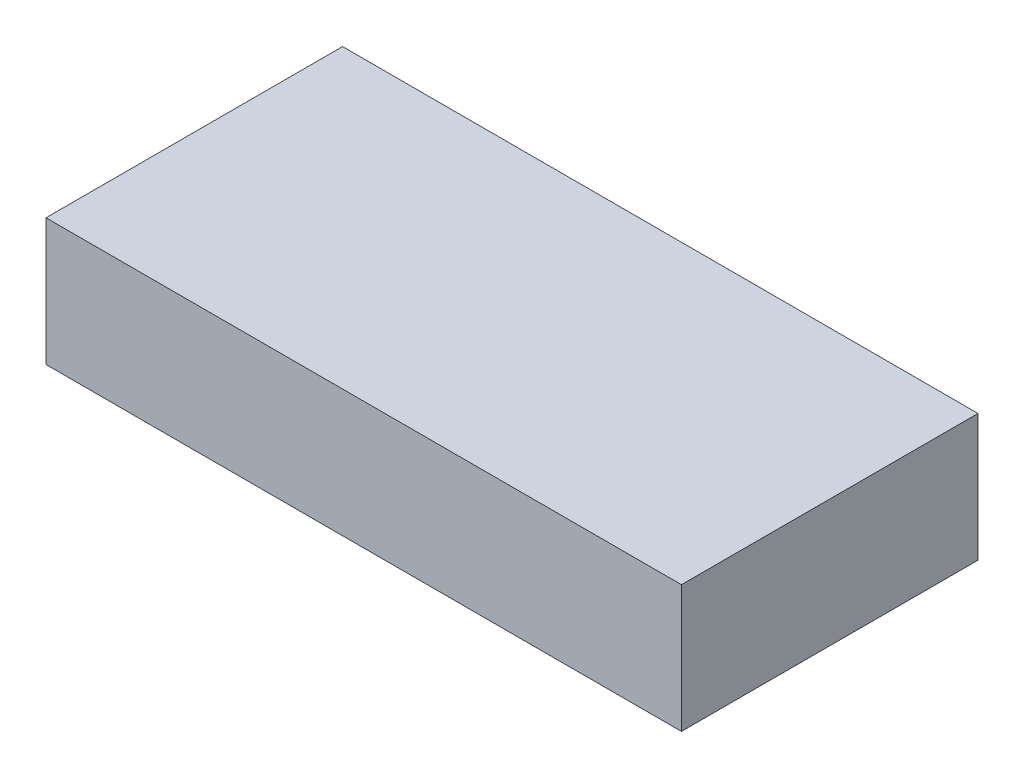
ISO-10303-21;
HEADER;
FILE_DESCRIPTION(('STEP AP214'),'2;1');
FILE_NAME('part.step','',(''),(''),'','','');
FILE_SCHEMA(('AUTOMOTIVE_DESIGN { 1 0 10303 214 1 1 1 1 }'));
ENDSEC;
DATA;
#1=APPLICATION_CONTEXT('core data for automotive mechanical design processes');
#2=APPLICATION_PROTOCOL_DEFINITION('international standard','automotive_design',2000,#1);
#3=PRODUCT_CONTEXT('',#1,'mechanical');
#4=PRODUCT('Part','Part','',(#3));
#5=PRODUCT_RELATED_PRODUCT_CATEGORY('part','',(#4));
#6=PRODUCT_DEFINITION_FORMATION('','',#4);
#7=PRODUCT_DEFINITION_CONTEXT('part definition',#1,'design');
#8=PRODUCT_DEFINITION('design','',#6,#7);
#9=PRODUCT_DEFINITION_SHAPE('','',#8);
#10=(LENGTH_UNIT() NAMED_UNIT(*) SI_UNIT(.MILLI.,.METRE.));
#11=(NAMED_UNIT(*) PLANE_ANGLE_UNIT() SI_UNIT($,.RADIAN.));
#12=(NAMED_UNIT(*) SI_UNIT($,.STERADIAN.) SOLID_ANGLE_UNIT());
#13=UNCERTAINTY_MEASURE_WITH_UNIT(LENGTH_MEASURE(1.E-05),#10,'distance_accuracy_value','');
#14=(GEOMETRIC_REPRESENTATION_CONTEXT(3) GLOBAL_UNCERTAINTY_ASSIGNED_CONTEXT((#13)) GLOBAL_UNIT_ASSIGNED_CONTEXT((#10,
#11,#12)) REPRESENTATION_CONTEXT('',''));
#15=CARTESIAN_POINT('',(0.,0.,0.));
#16=DIRECTION('',(0.,0.,1.));
#17=DIRECTION('',(1.,0.,0.));
#18=AXIS2_PLACEMENT_3D('',#15,#16,#17);
#19=CARTESIAN_POINT('',(0.,38.1,0.));
#20=DIRECTION('',(1.,0.,0.));
#21=DIRECTION('',(0.,0.,-1.));
#22=AXIS2_PLACEMENT_3D('',#19,#20,#21);
#23=PLANE('',#22);
#24=DIRECTION('',(0.,0.,1.));
#25=VECTOR('',#24,1.);
#26=CARTESIAN_POINT('',(0.,0.,0.));
#27=LINE('',#26,#25);
#28=CARTESIAN_POINT('',(0.,0.,-88.9));
#29=VERTEX_POINT('',#28);
#30=CARTESIAN_POINT('',(0.,0.,0.));
#31=VERTEX_POINT('',#30);
#32=EDGE_CURVE('E94',#29,#31,#27,.T.);
#33=ORIENTED_EDGE('',*,*,#32,.T.);
#34=DIRECTION('',(0.,-1.,0.));
#35=VECTOR('',#34,1.);
#36=CARTESIAN_POINT('',(0.,38.1,0.));
#37=LINE('',#36,#35);
#38=CARTESIAN_POINT('',(0.,38.1,0.));
#39=VERTEX_POINT('',#38);
#40=EDGE_CURVE('E11',#39,#31,#37,.T.);
#41=ORIENTED_EDGE('',*,*,#40,.F.);
#42=DIRECTION('',(0.,0.,1.));
#43=VECTOR('',#42,1.);
#44=CARTESIAN_POINT('',(0.,38.1,0.));
#45=LINE('',#44,#43);
#46=CARTESIAN_POINT('',(0.,38.1,-88.9));
#47=VERTEX_POINT('',#46);
#48=EDGE_CURVE('E82',#47,#39,#45,.T.);
#49=ORIENTED_EDGE('',*,*,#48,.F.);
#50=DIRECTION('',(0.,-1.,0.));
#51=VECTOR('',#50,1.);
#52=CARTESIAN_POINT('',(0.,38.1,-88.9));
#53=LINE('',#52,#51);
#54=EDGE_CURVE('E90',#47,#29,#53,.T.);
#55=ORIENTED_EDGE('',*,*,#54,.T.);
#56=EDGE_LOOP('',(#33,#41,#49,#55));
#57=FACE_BOUND('',#56,.T.);
#58=ADVANCED_FACE('F31',(#57),#23,.F.);
#59=CARTESIAN_POINT('',(0.,38.1,0.));
#60=DIRECTION('',(0.,0.,-1.));
#61=DIRECTION('',(-1.,0.,0.));
#62=AXIS2_PLACEMENT_3D('',#59,#60,#61);
#63=PLANE('',#62);
#64=DIRECTION('',(1.,0.,0.));
#65=VECTOR('',#64,1.);
#66=CARTESIAN_POINT('',(0.,0.,0.));
#67=LINE('',#66,#65);
#68=CARTESIAN_POINT('',(190.5,0.,0.));
#69=VERTEX_POINT('',#68);
#70=EDGE_CURVE('E86',#31,#69,#67,.T.);
#71=ORIENTED_EDGE('',*,*,#70,.T.);
#72=DIRECTION('',(0.,-1.,0.));
#73=VECTOR('',#72,1.);
#74=CARTESIAN_POINT('',(190.5,38.1,0.));
#75=LINE('',#74,#73);
#76=CARTESIAN_POINT('',(190.5,38.1,0.));
#77=VERTEX_POINT('',#76);
#78=EDGE_CURVE('E39',#77,#69,#75,.T.);
#79=ORIENTED_EDGE('',*,*,#78,.F.);
#80=DIRECTION('',(1.,0.,0.));
#81=VECTOR('',#80,1.);
#82=CARTESIAN_POINT('',(0.,38.1,0.));
#83=LINE('',#82,#81);
#84=EDGE_CURVE('E77',#39,#77,#83,.T.);
#85=ORIENTED_EDGE('',*,*,#84,.F.);
#86=ORIENTED_EDGE('',*,*,#40,.T.);
#87=EDGE_LOOP('',(#71,#79,#85,#86));
#88=FACE_BOUND('',#87,.T.);
#89=ADVANCED_FACE('F85',(#88),#63,.F.);
#90=CARTESIAN_POINT('',(190.5,38.1,0.));
#91=DIRECTION('',(-1.,0.,0.));
#92=DIRECTION('',(0.,0.,1.));
#93=AXIS2_PLACEMENT_3D('',#90,#91,#92);
#94=PLANE('',#93);
#95=DIRECTION('',(0.,0.,-1.));
#96=VECTOR('',#95,1.);
#97=CARTESIAN_POINT('',(190.5,0.,0.));
#98=LINE('',#97,#96);
#99=CARTESIAN_POINT('',(190.5,0.,-88.9));
#100=VERTEX_POINT('',#99);
#101=EDGE_CURVE('E64',#69,#100,#98,.T.);
#102=ORIENTED_EDGE('',*,*,#101,.T.);
#103=DIRECTION('',(0.,-1.,0.));
#104=VECTOR('',#103,1.);
#105=CARTESIAN_POINT('',(190.5,38.1,-88.9));
#106=LINE('',#105,#104);
#107=CARTESIAN_POINT('',(190.5,38.1,-88.9));
#108=VERTEX_POINT('',#107);
#109=EDGE_CURVE('E87',#108,#100,#106,.T.);
#110=ORIENTED_EDGE('',*,*,#109,.F.);
#111=DIRECTION('',(0.,0.,-1.));
#112=VECTOR('',#111,1.);
#113=CARTESIAN_POINT('',(190.5,38.1,0.));
#114=LINE('',#113,#112);
#115=EDGE_CURVE('E80',#77,#108,#114,.T.);
#116=ORIENTED_EDGE('',*,*,#115,.F.);
#117=ORIENTED_EDGE('',*,*,#78,.T.);
#118=EDGE_LOOP('',(#102,#110,#116,#117));
#119=FACE_BOUND('',#118,.T.);
#120=ADVANCED_FACE('F88',(#119),#94,.F.);
#121=CARTESIAN_POINT('',(0.,38.1,-88.9));
#122=DIRECTION('',(0.,0.,1.));
#123=DIRECTION('',(1.,0.,0.));
#124=AXIS2_PLACEMENT_3D('',#121,#122,#123);
#125=PLANE('',#124);
#126=DIRECTION('',(-1.,0.,0.));
#127=VECTOR('',#126,1.);
#128=CARTESIAN_POINT('',(0.,0.,-88.9));
#129=LINE('',#128,#127);
#130=EDGE_CURVE('E70',#100,#29,#129,.T.);
#131=ORIENTED_EDGE('',*,*,#130,.T.);
#132=ORIENTED_EDGE('',*,*,#54,.F.);
#133=DIRECTION('',(-1.,0.,0.));
#134=VECTOR('',#133,1.);
#135=CARTESIAN_POINT('',(0.,38.1,-88.9));
#136=LINE('',#135,#134);
#137=EDGE_CURVE('E47',#108,#47,#136,.T.);
#138=ORIENTED_EDGE('',*,*,#137,.F.);
#139=ORIENTED_EDGE('',*,*,#109,.T.);
#140=EDGE_LOOP('',(#131,#132,#138,#139));
#141=FACE_BOUND('',#140,.T.);
#142=ADVANCED_FACE('F101',(#141),#125,.F.);
#143=CARTESIAN_POINT('',(0.,38.1,-88.9));
#144=DIRECTION('',(0.,-1.,0.));
#145=DIRECTION('',(0.,0.,-1.));
#146=AXIS2_PLACEMENT_3D('',#143,#144,#145);
#147=PLANE('',#146);
#148=ORIENTED_EDGE('',*,*,#48,.T.);
#149=ORIENTED_EDGE('',*,*,#84,.T.);
#150=ORIENTED_EDGE('',*,*,#115,.T.);
#151=ORIENTED_EDGE('',*,*,#137,.T.);
#152=EDGE_LOOP('',(#148,#149,#150,#151));
#153=FACE_BOUND('',#152,.T.);
#154=ADVANCED_FACE('F78',(#153),#147,.F.);
#155=CARTESIAN_POINT('',(0.,0.,-88.9));
#156=DIRECTION('',(0.,-1.,0.));
#157=DIRECTION('',(0.,0.,-1.));
#158=AXIS2_PLACEMENT_3D('',#155,#156,#157);
#159=PLANE('',#158);
#160=ORIENTED_EDGE('',*,*,#32,.F.);
#161=ORIENTED_EDGE('',*,*,#130,.F.);
#162=ORIENTED_EDGE('',*,*,#101,.F.);
#163=ORIENTED_EDGE('',*,*,#70,.F.);
#164=EDGE_LOOP('',(#160,#161,#162,#163));
#165=FACE_BOUND('',#164,.T.);
#166=ADVANCED_FACE('F104',(#165),#159,.T.);
#167=CLOSED_SHELL('',(#58,#89,#120,#142,#154,#166));
#168=MANIFOLD_SOLID_BREP('B2',#167);
#169=ADVANCED_BREP_SHAPE_REPRESENTATION('',(#18,#168),#14);
#170=SHAPE_DEFINITION_REPRESENTATION(#9,#169);
ENDSEC;
END-ISO-10303-21;
